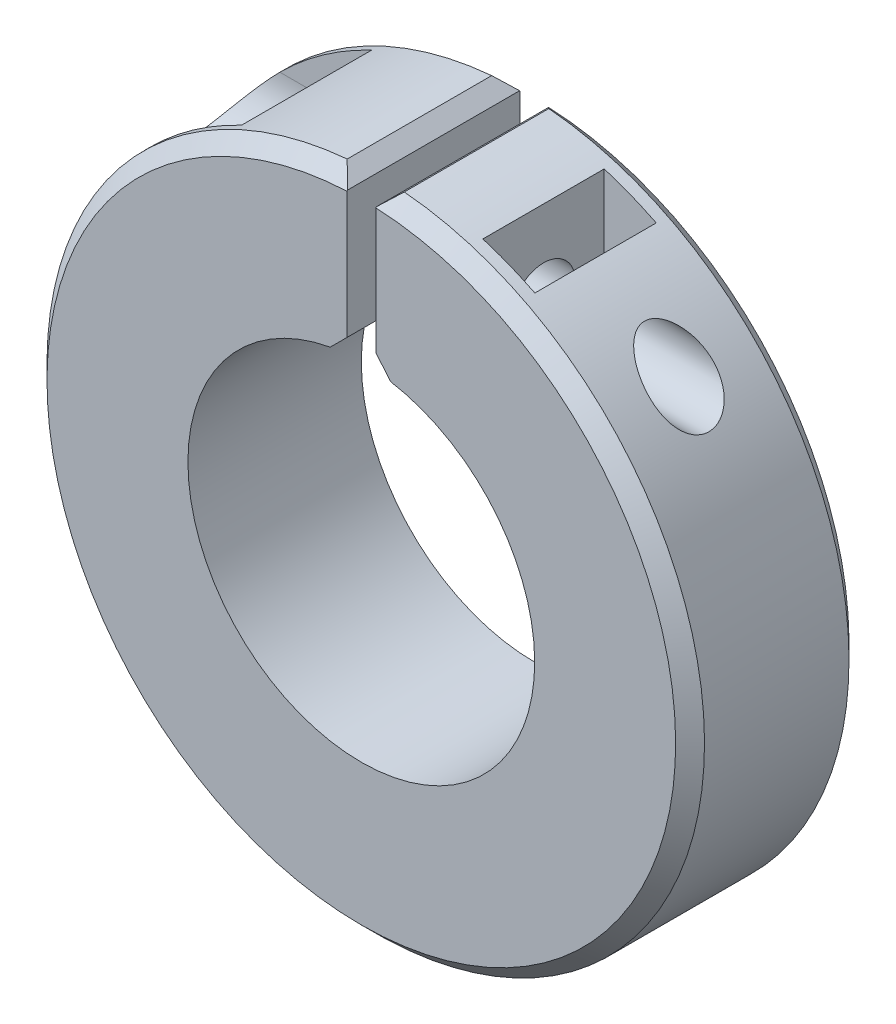
ISO-10303-21;
HEADER;
FILE_DESCRIPTION(('STEP AP214'),'2;1');
FILE_NAME('part.step','',(''),(''),'','','');
FILE_SCHEMA(('AUTOMOTIVE_DESIGN { 1 0 10303 214 1 1 1 1 }'));
ENDSEC;
DATA;
#1=APPLICATION_CONTEXT('core data for automotive mechanical design processes');
#2=APPLICATION_PROTOCOL_DEFINITION('international standard','automotive_design',2000,#1);
#3=PRODUCT_CONTEXT('',#1,'mechanical');
#4=PRODUCT('Part','Part','',(#3));
#5=PRODUCT_RELATED_PRODUCT_CATEGORY('part','',(#4));
#6=PRODUCT_DEFINITION_FORMATION('','',#4);
#7=PRODUCT_DEFINITION_CONTEXT('part definition',#1,'design');
#8=PRODUCT_DEFINITION('design','',#6,#7);
#9=PRODUCT_DEFINITION_SHAPE('','',#8);
#10=(LENGTH_UNIT() NAMED_UNIT(*) SI_UNIT(.MILLI.,.METRE.));
#11=(NAMED_UNIT(*) PLANE_ANGLE_UNIT() SI_UNIT($,.RADIAN.));
#12=(NAMED_UNIT(*) SI_UNIT($,.STERADIAN.) SOLID_ANGLE_UNIT());
#13=UNCERTAINTY_MEASURE_WITH_UNIT(LENGTH_MEASURE(1.E-05),#10,'distance_accuracy_value','');
#14=(GEOMETRIC_REPRESENTATION_CONTEXT(3) GLOBAL_UNCERTAINTY_ASSIGNED_CONTEXT((#13)) GLOBAL_UNIT_ASSIGNED_CONTEXT((#10,
#11,#12)) REPRESENTATION_CONTEXT('',''));
#15=CARTESIAN_POINT('',(0.,0.,0.));
#16=DIRECTION('',(0.,0.,1.));
#17=DIRECTION('',(1.,0.,0.));
#18=AXIS2_PLACEMENT_3D('',#15,#16,#17);
#19=CARTESIAN_POINT('',(11.3772735428193,8.02108519131541,322.453390593277));
#20=DIRECTION('',(-1.,0.,0.));
#21=DIRECTION('',(0.,0.,1.));
#22=AXIS2_PLACEMENT_3D('',#19,#20,#21);
#23=CYLINDRICAL_SURFACE('',#22,1.09999999999999);
#24=CARTESIAN_POINT('',(-0.5,8.02108519131541,322.453390593277));
#25=DIRECTION('',(-1.,0.,0.));
#26=DIRECTION('',(0.,-1.,0.));
#27=AXIS2_PLACEMENT_3D('',#24,#25,#26);
#28=CIRCLE('',#27,1.09999999999999);
#29=CARTESIAN_POINT('',(-0.5,6.92108519131542,322.453390593277));
#30=VERTEX_POINT('',#29);
#31=EDGE_CURVE('E359',#30,#30,#28,.F.);
#32=ORIENTED_EDGE('',*,*,#31,.T.);
#33=EDGE_LOOP('',(#32));
#34=FACE_BOUND('',#33,.T.);
#35=CARTESIAN_POINT('',(-4.89358378503082,8.02108519131541,322.453390593277));
#36=DIRECTION('',(-1.,0.,0.));
#37=DIRECTION('',(0.,0.,1.));
#38=AXIS2_PLACEMENT_3D('',#35,#36,#37);
#39=CIRCLE('',#38,1.09999999999999);
#40=CARTESIAN_POINT('',(-4.89358378503082,8.02108519131541,323.553390593277));
#41=VERTEX_POINT('',#40);
#42=EDGE_CURVE('E215',#41,#41,#39,.T.);
#43=ORIENTED_EDGE('',*,*,#42,.T.);
#44=EDGE_LOOP('',(#43));
#45=FACE_BOUND('',#44,.T.);
#46=ADVANCED_FACE('F39',(#34,#45),#23,.F.);
#47=CARTESIAN_POINT('',(0.,0.,319.453390593277));
#48=DIRECTION('',(0.,0.,1.));
#49=DIRECTION('',(1.,0.,0.));
#50=AXIS2_PLACEMENT_3D('',#47,#48,#49);
#51=CYLINDRICAL_SURFACE('',#50,11.3772735428193);
#52=CARTESIAN_POINT('',(0.,0.,324.953390593277));
#53=DIRECTION('',(0.,0.,1.));
#54=DIRECTION('',(1.,0.,0.));
#55=AXIS2_PLACEMENT_3D('',#52,#53,#54);
#56=CIRCLE('',#55,11.3772735428193);
#57=CARTESIAN_POINT('',(0.988530535673437,11.3342472466493,324.953390593277));
#58=VERTEX_POINT('',#57);
#59=CARTESIAN_POINT('',(-0.98853053567343,11.3342472466493,324.953390593277));
#60=VERTEX_POINT('',#59);
#61=EDGE_CURVE('E470',#58,#60,#56,.F.);
#62=ORIENTED_EDGE('',*,*,#61,.T.);
#63=DIRECTION('',(0.,0.,1.));
#64=VECTOR('',#63,1.);
#65=CARTESIAN_POINT('',(-0.98853053567343,11.3342472466493,319.453390593277));
#66=LINE('',#65,#64);
#67=CARTESIAN_POINT('',(-0.98853053567343,11.3342472466493,319.953390593278));
#68=VERTEX_POINT('',#67);
#69=EDGE_CURVE('E468',#60,#68,#66,.F.);
#70=ORIENTED_EDGE('',*,*,#69,.T.);
#71=CARTESIAN_POINT('',(0.,0.,319.953390593278));
#72=DIRECTION('',(0.,0.,1.));
#73=DIRECTION('',(1.,0.,0.));
#74=AXIS2_PLACEMENT_3D('',#71,#72,#73);
#75=CIRCLE('',#74,11.3772735428193);
#76=CARTESIAN_POINT('',(0.988530535673437,11.3342472466493,319.953390593278));
#77=VERTEX_POINT('',#76);
#78=EDGE_CURVE('E473',#68,#77,#75,.T.);
#79=ORIENTED_EDGE('',*,*,#78,.T.);
#80=DIRECTION('',(0.,0.,1.));
#81=VECTOR('',#80,1.);
#82=CARTESIAN_POINT('',(0.988530535673438,11.3342472466493,319.453390593277));
#83=LINE('',#82,#81);
#84=EDGE_CURVE('E475',#77,#58,#83,.T.);
#85=ORIENTED_EDGE('',*,*,#84,.T.);
#86=EDGE_LOOP('',(#62,#70,#79,#85));
#87=FACE_BOUND('',#86,.T.);
#88=DIRECTION('',(0.,0.,1.));
#89=VECTOR('',#88,1.);
#90=CARTESIAN_POINT('',(5.10641621496918,10.1669497248504,319.453390593277));
#91=LINE('',#90,#89);
#92=CARTESIAN_POINT('',(5.10641621496918,10.1669497248504,324.553390593277));
#93=VERTEX_POINT('',#92);
#94=CARTESIAN_POINT('',(5.10641621496918,10.1669497248504,320.353390593277));
#95=VERTEX_POINT('',#94);
#96=EDGE_CURVE('E213',#93,#95,#91,.F.);
#97=ORIENTED_EDGE('',*,*,#96,.F.);
#98=CARTESIAN_POINT('',(0.,0.,324.553390593277));
#99=DIRECTION('',(0.,0.,-1.));
#100=DIRECTION('',(-1.,0.,0.));
#101=AXIS2_PLACEMENT_3D('',#98,#99,#100);
#102=CIRCLE('',#101,11.3772735428193);
#103=CARTESIAN_POINT('',(3.30641621496918,10.8862282302699,324.553390593277));
#104=VERTEX_POINT('',#103);
#105=EDGE_CURVE('E271',#93,#104,#102,.F.);
#106=ORIENTED_EDGE('',*,*,#105,.T.);
#107=DIRECTION('',(0.,0.,1.));
#108=VECTOR('',#107,1.);
#109=CARTESIAN_POINT('',(3.30641621496918,10.8862282302699,319.453390593277));
#110=LINE('',#109,#108);
#111=CARTESIAN_POINT('',(3.30641621496918,10.8862282302699,320.353390593277));
#112=VERTEX_POINT('',#111);
#113=EDGE_CURVE('E205',#104,#112,#110,.F.);
#114=ORIENTED_EDGE('',*,*,#113,.T.);
#115=CARTESIAN_POINT('',(0.,0.,320.353390593277));
#116=DIRECTION('',(0.,0.,1.));
#117=DIRECTION('',(1.,0.,0.));
#118=AXIS2_PLACEMENT_3D('',#115,#116,#117);
#119=CIRCLE('',#118,11.3772735428193);
#120=EDGE_CURVE('E277',#112,#95,#119,.F.);
#121=ORIENTED_EDGE('',*,*,#120,.T.);
#122=EDGE_LOOP('',(#97,#106,#114,#121));
#123=FACE_BOUND('',#122,.T.);
#124=CARTESIAN_POINT('',(8.06873878755513,8.02108519131541,323.553390593277));
#125=CARTESIAN_POINT('',(8.13419799544364,7.95523722157848,323.553390436037));
#126=CARTESIAN_POINT('',(8.19885524797418,7.88857512960789,323.547494872667));
#127=CARTESIAN_POINT('',(8.32540879857754,7.75489350094532,323.522856722746));
#128=CARTESIAN_POINT('',(8.38730526720678,7.68787398662146,323.504114930987));
#129=CARTESIAN_POINT('',(8.49913749995524,7.56393218795188,323.455812053112));
#130=CARTESIAN_POINT('',(8.54958820369349,7.50681898200338,323.427950560727));
#131=CARTESIAN_POINT('',(8.64593750834966,7.39564083546103,323.36060102943));
#132=CARTESIAN_POINT('',(8.69184130948544,7.34157244384051,323.321126482287));
#133=CARTESIAN_POINT('',(8.76866289253158,7.24953389676741,323.239320235526));
#134=CARTESIAN_POINT('',(8.8007247152446,7.21053422049426,323.199228120861));
#135=CARTESIAN_POINT('',(8.85987360393305,7.13772978933381,323.111362604787));
#136=CARTESIAN_POINT('',(8.8869662127495,7.10391925325103,323.063597874673));
#137=CARTESIAN_POINT('',(8.93125153908117,7.04813229419682,322.969032953939));
#138=CARTESIAN_POINT('',(8.9493303339184,7.02513166178924,322.923254680345));
#139=CARTESIAN_POINT('',(8.98042351370397,6.98534085118089,322.827448167334));
#140=CARTESIAN_POINT('',(8.99343988050689,6.9685482427718,322.777421600415));
#141=CARTESIAN_POINT('',(9.01384461456682,6.94213535796251,322.674120220993));
#142=CARTESIAN_POINT('',(9.02120571319764,6.93254983744178,322.620830991499));
#143=CARTESIAN_POINT('',(9.02979307851886,6.92136137073332,322.512934308412));
#144=CARTESIAN_POINT('',(9.03102137136142,6.91975578813999,322.458327296178));
#145=CARTESIAN_POINT('',(9.02744279501485,6.92442298337805,322.354359463626));
#146=CARTESIAN_POINT('',(9.02314276845133,6.93003413957071,322.3049491552));
#147=CARTESIAN_POINT('',(9.00956816061822,6.94767279024034,322.20800724614));
#148=CARTESIAN_POINT('',(9.00029377106121,6.95970003744026,322.160475573179));
#149=CARTESIAN_POINT('',(8.97704062711779,6.98966772506335,322.067941763071));
#150=CARTESIAN_POINT('',(8.96301112630929,7.00767190669873,322.022973298008));
#151=CARTESIAN_POINT('',(8.93080835966013,7.04866606868939,321.936987075499));
#152=CARTESIAN_POINT('',(8.91263391093269,7.07165747220816,321.895970450594));
#153=CARTESIAN_POINT('',(8.87042813157629,7.12454376813006,321.813970870519));
#154=CARTESIAN_POINT('',(8.84596483630395,7.15492732248187,321.773527420311));
#155=CARTESIAN_POINT('',(8.79336664904601,7.21947345919028,321.698490871236));
#156=CARTESIAN_POINT('',(8.76522926623596,7.25363860283593,321.663901778156));
#157=CARTESIAN_POINT('',(8.69147567650685,7.34202352381444,321.585124639525));
#158=CARTESIAN_POINT('',(8.64402935629384,7.3978953307076,321.544486595238));
#159=CARTESIAN_POINT('',(8.54430655227201,7.5128565595056,321.475526914745));
#160=CARTESIAN_POINT('',(8.4920199535704,7.57195260842165,321.447231809957));
#161=CARTESIAN_POINT('',(8.36743908039974,7.70969139261483,321.395092148205));
#162=CARTESIAN_POINT('',(8.29393241530082,7.78876244138324,321.375284312445));
#163=CARTESIAN_POINT('',(8.14346413603564,7.94595737726953,321.353085945875));
#164=CARTESIAN_POINT('',(8.06649970870372,8.02408042500169,321.350709865162));
#165=CARTESIAN_POINT('',(7.90955435100821,8.17885491468219,321.361952697905));
#166=CARTESIAN_POINT('',(7.82954406390905,8.25545462252588,321.375860040794));
#167=CARTESIAN_POINT('',(7.66962521747124,8.40423218904353,321.419364027422));
#168=CARTESIAN_POINT('',(7.58971667245338,8.47640948087444,321.44896267772));
#169=CARTESIAN_POINT('',(7.44303991073207,8.6053305441214,321.518898537358));
#170=CARTESIAN_POINT('',(7.37597138563548,8.6628339561287,321.557208783552));
#171=CARTESIAN_POINT('',(7.24569459841096,8.7720820790236,321.646557563664));
#172=CARTESIAN_POINT('',(7.18247908030914,8.82383777533058,321.697571190822));
#173=CARTESIAN_POINT('',(7.08630068998664,8.90106419514713,321.791730326199));
#174=CARTESIAN_POINT('',(7.0510020206024,8.92902628003682,321.830444151592));
#175=CARTESIAN_POINT('',(6.98475249911632,8.98094323932491,321.913871380071));
#176=CARTESIAN_POINT('',(6.9537956973386,9.00490360605909,321.958576405717));
#177=CARTESIAN_POINT('',(6.90493438319942,9.04239750483778,322.042884441363));
#178=CARTESIAN_POINT('',(6.88567475085066,9.05705667605565,322.081190980568));
#179=CARTESIAN_POINT('',(6.85222005516111,9.08239368409729,322.16119821454));
#180=CARTESIAN_POINT('',(6.83801736286917,9.09307751925946,322.202893679004));
#181=CARTESIAN_POINT('',(6.8177370755399,9.10829022440171,322.282088421086));
#182=CARTESIAN_POINT('',(6.81073078764729,9.11352447299242,322.319211084303));
#183=CARTESIAN_POINT('',(6.80185762862985,9.12014903843459,322.394401676771));
#184=CARTESIAN_POINT('',(6.79998744678623,9.12154183147945,322.43246898113));
#185=CARTESIAN_POINT('',(6.80156739467081,9.120363742418,322.508445603341));
#186=CARTESIAN_POINT('',(6.80501999025771,9.11779102322713,322.546354839806));
#187=CARTESIAN_POINT('',(6.81691382061168,9.10890182953345,322.620928905873));
#188=CARTESIAN_POINT('',(6.82535885480551,9.10258250371657,322.657592765202));
#189=CARTESIAN_POINT('',(6.84938530686184,9.0845227163534,322.738422073182));
#190=CARTESIAN_POINT('',(6.86627086240936,9.07178471680746,322.781973209796));
#191=CARTESIAN_POINT('',(6.90531626541429,9.04209949001199,322.865079457754));
#192=CARTESIAN_POINT('',(6.92748611424316,9.02514427833252,322.904626786541));
#193=CARTESIAN_POINT('',(6.98713666887674,8.97910196311206,322.997472578914));
#194=CARTESIAN_POINT('',(7.02687956953758,8.9480835344006,323.048345323501));
#195=CARTESIAN_POINT('',(7.11149035699483,8.88099128833574,323.141780148419));
#196=CARTESIAN_POINT('',(7.15637034841035,8.84490548333245,323.184321931917));
#197=CARTESIAN_POINT('',(7.27370811319863,8.74893458046126,323.282313499344));
#198=CARTESIAN_POINT('',(7.3482522131905,8.68651684034621,323.332778757443));
#199=CARTESIAN_POINT('',(7.50051732760421,8.5553930390172,323.418080824386));
#200=CARTESIAN_POINT('',(7.57824077429957,8.48668211163029,323.452905414222));
#201=CARTESIAN_POINT('',(7.72528241142001,8.35290653053916,323.504292254857));
#202=CARTESIAN_POINT('',(7.79450592522495,8.28837375006615,323.522528864531));
#203=CARTESIAN_POINT('',(7.93235205627186,8.15654495204298,323.54707311801));
#204=CARTESIAN_POINT('',(8.00097512888409,8.08925129795444,323.553390756053));
#205=CARTESIAN_POINT('',(8.06873878755513,8.02108519131541,323.553390593277));
#206=B_SPLINE_CURVE_WITH_KNOTS('',3,(#124,#125,#126,#127,#128,#129,#130,#131,#132,#133,#134,
#135,#136,#137,#138,#139,#140,#141,#142,#143,#144,#145,#146,#147,#148,#149,#150,#151,#152,#153,
#154,#155,#156,#157,#158,#159,#160,#161,#162,#163,#164,#165,#166,#167,#168,#169,#170,#171,#172,
#173,#174,#175,#176,#177,#178,#179,#180,#181,#182,#183,#184,#185,#186,#187,#188,#189,#190,#191,
#192,#193,#194,#195,#196,#197,#198,#199,#200,#201,#202,#203,#204,#205),.UNSPECIFIED.,.T.,.F.,(4,
2,2,2,2,2,2,2,2,2,2,2,2,2,2,2,2,2,2,2,2,2,2,2,2,2,2,2,2,2,2,2,2,2,2,2,2,2,2,2,4),(0.,
0.278343473950357,0.556669728442386,0.79923381377863,1.04151719938212,1.2341967707426,
1.42666009564916,1.58896163248053,1.75119956690725,1.91421495550189,2.07717648361915,
2.22620996535901,2.37523770374218,2.52590874145476,2.67662283164831,2.84456026230144,
3.01261214199396,3.26265319912206,3.51322910785106,3.84077334921865,4.16858907854234,
4.50230038817185,4.83605438214404,5.12407976754291,5.41154482478995,5.58926117056258,
5.76673156068403,5.90220096031759,6.03746511476441,6.15137673116412,6.26521490321854,
6.37910582841046,6.49308354050865,6.63752636592858,6.78224477422384,6.99591439829325,
7.21009828330773,7.53696873805933,7.86409411255998,8.15247841800768,8.44062080118788),.UNSPECIFIED.);
#207=CARTESIAN_POINT('',(8.06873878755513,8.02108519131541,323.553390593277));
#208=VERTEX_POINT('',#207);
#209=EDGE_CURVE('E218',#208,#208,#206,.T.);
#210=ORIENTED_EDGE('',*,*,#209,.F.);
#211=EDGE_LOOP('',(#210));
#212=FACE_BOUND('',#211,.T.);
#213=CARTESIAN_POINT('',(0.,0.,324.703390593277));
#214=DIRECTION('',(0.,0.,1.));
#215=DIRECTION('',(1.,0.,0.));
#216=AXIS2_PLACEMENT_3D('',#213,#214,#215);
#217=CIRCLE('',#216,11.3772735428193);
#218=CARTESIAN_POINT('',(-8.06873878755513,8.02108519131541,324.703390593277));
#219=VERTEX_POINT('',#218);
#220=CARTESIAN_POINT('',(-4.89358378503082,10.2710851913038,324.703390593277));
#221=VERTEX_POINT('',#220);
#222=EDGE_CURVE('E267',#219,#221,#217,.F.);
#223=ORIENTED_EDGE('',*,*,#222,.F.);
#224=CARTESIAN_POINT('',(-8.06873878755513,8.02108519131541,320.203390593277));
#225=CARTESIAN_POINT('',(-8.13551263076985,7.95392722340364,320.203396809345));
#226=CARTESIAN_POINT('',(-8.20145995912195,7.88589843451153,320.206399117038));
#227=CARTESIAN_POINT('',(-8.33144806549425,7.74843446404324,320.218901438893));
#228=CARTESIAN_POINT('',(-8.39548572965339,7.6789972658449,320.228411518115));
#229=CARTESIAN_POINT('',(-8.52172088232586,7.53867450876376,320.254547529734));
#230=CARTESIAN_POINT('',(-8.58389834151709,7.46778167800933,320.271232691476));
#231=CARTESIAN_POINT('',(-8.70536842347618,7.32582058072846,320.312230598037));
#232=CARTESIAN_POINT('',(-8.76466287293524,7.25475245607534,320.336538438379));
#233=CARTESIAN_POINT('',(-8.91256628316013,7.07310789684687,320.409354593062));
#234=CARTESIAN_POINT('',(-8.99882033517275,6.96288444679273,320.463777427772));
#235=CARTESIAN_POINT('',(-9.16099393124427,6.74808047568554,320.593915363407));
#236=CARTESIAN_POINT('',(-9.23694958527804,6.64348105680305,320.669553054172));
#237=CARTESIAN_POINT('',(-9.3664529557537,6.45931004892415,320.82982037415));
#238=CARTESIAN_POINT('',(-9.42165333219912,6.37832310280961,320.911475114645));
#239=CARTESIAN_POINT('',(-9.52207096913754,6.2274185532392,321.089973458057));
#240=CARTESIAN_POINT('',(-9.56728456364406,6.15750501730914,321.186822616362));
#241=CARTESIAN_POINT('',(-9.64679721207819,6.03218222419049,321.394367467776));
#242=CARTESIAN_POINT('',(-9.68103845405879,5.97685005730771,321.505132356555));
#243=CARTESIAN_POINT('',(-9.73741419095665,5.8845625864918,321.736937216623));
#244=CARTESIAN_POINT('',(-9.75955534458225,5.84759717630665,321.85797149419));
#245=CARTESIAN_POINT('',(-9.78960582710361,5.79713214641975,322.093469986537));
#246=CARTESIAN_POINT('',(-9.79873171803235,5.78163135372316,322.20735388675));
#247=CARTESIAN_POINT('',(-9.80662932733087,5.76822714744707,322.436493906071));
#248=CARTESIAN_POINT('',(-9.80540467913991,5.77031755867402,322.551749529465));
#249=CARTESIAN_POINT('',(-9.79293435194685,5.7914522891011,322.774602016518));
#250=CARTESIAN_POINT('',(-9.78216441809358,5.80969168584008,322.882303594864));
#251=CARTESIAN_POINT('',(-9.75144629070035,5.86110373660042,323.092691501714));
#252=CARTESIAN_POINT('',(-9.73149866825107,5.89427546144023,323.195378141836));
#253=CARTESIAN_POINT('',(-9.68241155116305,5.97457044305528,323.394663417804));
#254=CARTESIAN_POINT('',(-9.65313757580243,6.02189715380799,323.491146463228));
#255=CARTESIAN_POINT('',(-9.58604399588447,6.12813599572184,323.674233351987));
#256=CARTESIAN_POINT('',(-9.54822183878201,6.1870515867185,323.760834232795));
#257=CARTESIAN_POINT('',(-9.46167602028526,6.31867607469962,323.928684676983));
#258=CARTESIAN_POINT('',(-9.4123578405323,6.39207817542667,324.009081218419));
#259=CARTESIAN_POINT('',(-9.30570702296889,6.54637075996319,324.156060473094));
#260=CARTESIAN_POINT('',(-9.24837412833246,6.62726148371236,324.222642743494));
#261=CARTESIAN_POINT('',(-9.11848949663876,6.80508455559322,324.350063785323));
#262=CARTESIAN_POINT('',(-9.0449282190006,6.90270600391572,324.408904413466));
#263=CARTESIAN_POINT('',(-8.89021653483896,7.10086482614958,324.509623525833));
#264=CARTESIAN_POINT('',(-8.80904998080316,7.20140807666923,324.551464864746));
#265=CARTESIAN_POINT('',(-8.6226765296507,7.42408595667094,324.626561522966));
#266=CARTESIAN_POINT('',(-8.5160261976056,7.54626867734381,324.656103014086));
#267=CARTESIAN_POINT('',(-8.35133634372771,7.72684832445702,324.684897790134));
#268=CARTESIAN_POINT('',(-8.29578856851162,7.78645699117235,324.691911371906));
#269=CARTESIAN_POINT('',(-8.18328526813401,7.90460857421248,324.701151731181));
#270=CARTESIAN_POINT('',(-8.12633108776726,7.96315242225198,324.703382914982));
#271=CARTESIAN_POINT('',(-8.06873878755513,8.02108519131541,324.703390593277));
#272=B_SPLINE_CURVE_WITH_KNOTS('',3,(#224,#225,#226,#227,#228,#229,#230,#231,#232,#233,#234,
#235,#236,#237,#238,#239,#240,#241,#242,#243,#244,#245,#246,#247,#248,#249,#250,#251,#252,#253,
#254,#255,#256,#257,#258,#259,#260,#261,#262,#263,#264,#265,#266,#267,#268,#269,#270,#271),
.UNSPECIFIED.,.F.,.F.,(4,2,2,2,2,2,2,2,2,2,2,2,2,2,2,2,2,2,2,2,2,2,2,4),(0.,0.28410949893573,
0.56865940387877,0.8556047318457,1.14236581497815,1.59106574168695,2.03814925852667,
2.41924533203505,2.80048106812369,3.18369366293628,3.56669516201925,3.91081667812633,
4.25481739930072,4.58258046604722,4.91032314017282,5.24302357042188,5.57582347884491,
5.93293404551933,6.29005605817934,6.69552953882858,7.10188431897127,7.59458796518256,
7.83980224624937,8.08479049998168),.UNSPECIFIED.);
#273=CARTESIAN_POINT('',(-8.06873878755513,8.02108519131541,320.203390593277));
#274=VERTEX_POINT('',#273);
#275=EDGE_CURVE('E260',#274,#219,#272,.T.);
#276=ORIENTED_EDGE('',*,*,#275,.F.);
#277=CARTESIAN_POINT('',(0.,0.,320.203390593277));
#278=DIRECTION('',(0.,0.,-1.));
#279=DIRECTION('',(-1.,0.,0.));
#280=AXIS2_PLACEMENT_3D('',#277,#278,#279);
#281=CIRCLE('',#280,11.3772735428193);
#282=CARTESIAN_POINT('',(-4.89358378503082,10.2710851913154,320.203390593277));
#283=VERTEX_POINT('',#282);
#284=EDGE_CURVE('E268',#283,#274,#281,.F.);
#285=ORIENTED_EDGE('',*,*,#284,.F.);
#286=DIRECTION('',(0.,0.,1.));
#287=VECTOR('',#286,1.);
#288=CARTESIAN_POINT('',(-4.89358378503082,10.2710851913154,324.703390593277));
#289=LINE('',#288,#287);
#290=EDGE_CURVE('E386',#283,#221,#289,.T.);
#291=ORIENTED_EDGE('',*,*,#290,.T.);
#292=EDGE_LOOP('',(#223,#276,#285,#291));
#293=FACE_BOUND('',#292,.T.);
#294=ADVANCED_FACE('F228',(#87,#123,#212,#293),#51,.T.);
#295=CARTESIAN_POINT('',(0.500000000000002,8.02108519131541,322.453390593277));
#296=DIRECTION('',(1.,0.,0.));
#297=DIRECTION('',(0.,1.,0.));
#298=AXIS2_PLACEMENT_3D('',#295,#296,#297);
#299=CIRCLE('',#298,1.09999999999999);
#300=CARTESIAN_POINT('',(0.500000000000002,9.12108519131541,322.453390593277));
#301=VERTEX_POINT('',#300);
#302=EDGE_CURVE('E355',#301,#301,#299,.F.);
#303=ORIENTED_EDGE('',*,*,#302,.T.);
#304=EDGE_LOOP('',(#303));
#305=FACE_BOUND('',#304,.T.);
#306=CARTESIAN_POINT('',(3.30641621496918,8.02108519131541,322.453390593277));
#307=DIRECTION('',(1.,0.,0.));
#308=DIRECTION('',(0.,0.,-1.));
#309=AXIS2_PLACEMENT_3D('',#306,#307,#308);
#310=CIRCLE('',#309,1.09999999999999);
#311=CARTESIAN_POINT('',(3.30641621496918,8.02108519131541,321.353390593277));
#312=VERTEX_POINT('',#311);
#313=EDGE_CURVE('E201',#312,#312,#310,.F.);
#314=ORIENTED_EDGE('',*,*,#313,.F.);
#315=EDGE_LOOP('',(#314));
#316=FACE_BOUND('',#315,.T.);
#317=ADVANCED_FACE('F239',(#305,#316),#23,.F.);
#318=CARTESIAN_POINT('',(0.,0.,319.453390593277));
#319=DIRECTION('',(0.,0.,1.));
#320=DIRECTION('',(1.,0.,0.));
#321=AXIS2_PLACEMENT_3D('',#318,#319,#320);
#322=CYLINDRICAL_SURFACE('',#321,5.99999999998992);
#323=CARTESIAN_POINT('',(0.,0.,319.453390593277));
#324=DIRECTION('',(0.,0.,1.));
#325=DIRECTION('',(1.,0.,0.));
#326=AXIS2_PLACEMENT_3D('',#323,#324,#325);
#327=CIRCLE('',#326,5.99999999998992);
#328=CARTESIAN_POINT('',(-1.07648938625642,5.90264098528416,319.453390593277));
#329=VERTEX_POINT('',#328);
#330=CARTESIAN_POINT('',(1.01910162368152,5.91281928359803,319.453390593277));
#331=VERTEX_POINT('',#330);
#332=EDGE_CURVE('E396',#329,#331,#327,.T.);
#333=ORIENTED_EDGE('',*,*,#332,.F.);
#334=DIRECTION('',(0.,0.,1.));
#335=VECTOR('',#334,1.);
#336=CARTESIAN_POINT('',(-1.07648938625642,5.90264098528416,319.453390593277));
#337=LINE('',#336,#335);
#338=CARTESIAN_POINT('',(-1.07648938625642,5.90264098528416,325.453390593277));
#339=VERTEX_POINT('',#338);
#340=EDGE_CURVE('E11',#329,#339,#337,.T.);
#341=ORIENTED_EDGE('',*,*,#340,.T.);
#342=CARTESIAN_POINT('',(0.,0.,325.453390593277));
#343=DIRECTION('',(0.,0.,1.));
#344=DIRECTION('',(1.,0.,0.));
#345=AXIS2_PLACEMENT_3D('',#342,#343,#344);
#346=CIRCLE('',#345,5.99999999998992);
#347=CARTESIAN_POINT('',(1.01910162368152,5.91281928359803,325.453390593277));
#348=VERTEX_POINT('',#347);
#349=EDGE_CURVE('E393',#339,#348,#346,.T.);
#350=ORIENTED_EDGE('',*,*,#349,.T.);
#351=DIRECTION('',(0.,0.,1.));
#352=VECTOR('',#351,1.);
#353=CARTESIAN_POINT('',(1.01910162368152,5.91281928359804,319.453390593277));
#354=LINE('',#353,#352);
#355=EDGE_CURVE('E55',#348,#331,#354,.F.);
#356=ORIENTED_EDGE('',*,*,#355,.T.);
#357=EDGE_LOOP('',(#333,#341,#350,#356));
#358=FACE_BOUND('',#357,.T.);
#359=ADVANCED_FACE('F347',(#358),#322,.F.);
#360=CARTESIAN_POINT('',(0.,0.,319.453390593277));
#361=DIRECTION('',(0.,0.,1.));
#362=DIRECTION('',(1.,0.,0.));
#363=AXIS2_PLACEMENT_3D('',#360,#361,#362);
#364=PLANE('',#363);
#365=DIRECTION('',(0.,1.,0.));
#366=VECTOR('',#365,1.);
#367=CARTESIAN_POINT('',(0.500000000000002,5.97913037154059,319.453390593277));
#368=LINE('',#367,#366);
#369=CARTESIAN_POINT('',(0.500000000000002,6.52666251561539,319.453390593277));
#370=VERTEX_POINT('',#369);
#371=CARTESIAN_POINT('',(0.5,10.8657756154504,319.453390593277));
#372=VERTEX_POINT('',#371);
#373=EDGE_CURVE('E364',#370,#372,#368,.T.);
#374=ORIENTED_EDGE('',*,*,#373,.T.);
#375=CARTESIAN_POINT('',(0.,0.,319.453390593277));
#376=DIRECTION('',(0.,0.,1.));
#377=DIRECTION('',(1.,0.,0.));
#378=AXIS2_PLACEMENT_3D('',#375,#376,#377);
#379=CIRCLE('',#378,10.8772735428193);
#380=CARTESIAN_POINT('',(-0.5,10.8657756154504,319.453390593277));
#381=VERTEX_POINT('',#380);
#382=EDGE_CURVE('E417',#372,#381,#379,.F.);
#383=ORIENTED_EDGE('',*,*,#382,.T.);
#384=DIRECTION('',(0.,-1.,0.));
#385=VECTOR('',#384,1.);
#386=CARTESIAN_POINT('',(-0.5,5.97913037154059,319.453390593277));
#387=LINE('',#386,#385);
#388=CARTESIAN_POINT('',(-0.5,6.47913037154059,319.453390593277));
#389=VERTEX_POINT('',#388);
#390=EDGE_CURVE('E360',#381,#389,#387,.T.);
#391=ORIENTED_EDGE('',*,*,#390,.T.);
#392=DIRECTION('',(0.707106781186546,0.707106781186549,0.));
#393=VECTOR('',#392,1.);
#394=CARTESIAN_POINT('',(-1.07648938625642,5.90264098528416,319.453390593277));
#395=LINE('',#394,#393);
#396=EDGE_CURVE('E69',#389,#329,#395,.F.);
#397=ORIENTED_EDGE('',*,*,#396,.T.);
#398=ORIENTED_EDGE('',*,*,#332,.T.);
#399=DIRECTION('',(0.645721706788006,-0.763572836985958,0.));
#400=VECTOR('',#399,1.);
#401=CARTESIAN_POINT('',(0.500000000000002,6.52666251561539,319.453390593277));
#402=LINE('',#401,#400);
#403=EDGE_CURVE('E408',#331,#370,#402,.F.);
#404=ORIENTED_EDGE('',*,*,#403,.T.);
#405=EDGE_LOOP('',(#374,#383,#391,#397,#398,#404));
#406=FACE_BOUND('',#405,.T.);
#407=ADVANCED_FACE('F258',(#406),#364,.F.);
#408=CARTESIAN_POINT('',(0.,0.,325.453390593277));
#409=DIRECTION('',(0.,0.,1.));
#410=DIRECTION('',(1.,0.,0.));
#411=AXIS2_PLACEMENT_3D('',#408,#409,#410);
#412=PLANE('',#411);
#413=DIRECTION('',(0.,-1.,0.));
#414=VECTOR('',#413,1.);
#415=CARTESIAN_POINT('',(-0.499999999999999,0.,325.453390593277));
#416=LINE('',#415,#414);
#417=CARTESIAN_POINT('',(-0.5,10.8657756154504,325.453390593277));
#418=VERTEX_POINT('',#417);
#419=CARTESIAN_POINT('',(-0.5,6.47913037154059,325.453390593277));
#420=VERTEX_POINT('',#419);
#421=EDGE_CURVE('E283',#418,#420,#416,.T.);
#422=ORIENTED_EDGE('',*,*,#421,.F.);
#423=CARTESIAN_POINT('',(0.,0.,325.453390593277));
#424=DIRECTION('',(0.,0.,1.));
#425=DIRECTION('',(1.,0.,0.));
#426=AXIS2_PLACEMENT_3D('',#423,#424,#425);
#427=CIRCLE('',#426,10.8772735428193);
#428=CARTESIAN_POINT('',(0.5,10.8657756154504,325.453390593277));
#429=VERTEX_POINT('',#428);
#430=EDGE_CURVE('E290',#418,#429,#427,.T.);
#431=ORIENTED_EDGE('',*,*,#430,.T.);
#432=DIRECTION('',(0.,1.,0.));
#433=VECTOR('',#432,1.);
#434=CARTESIAN_POINT('',(0.500000000000004,0.,325.453390593277));
#435=LINE('',#434,#433);
#436=CARTESIAN_POINT('',(0.500000000000002,6.52666251561539,325.453390593277));
#437=VERTEX_POINT('',#436);
#438=EDGE_CURVE('E280',#437,#429,#435,.T.);
#439=ORIENTED_EDGE('',*,*,#438,.F.);
#440=DIRECTION('',(-0.645721706788006,0.763572836985958,0.));
#441=VECTOR('',#440,1.);
#442=CARTESIAN_POINT('',(3.50952895125161,2.96786228458489,325.453390593277));
#443=LINE('',#442,#441);
#444=EDGE_CURVE('E286',#437,#348,#443,.F.);
#445=ORIENTED_EDGE('',*,*,#444,.T.);
#446=ORIENTED_EDGE('',*,*,#349,.F.);
#447=DIRECTION('',(-0.707106781186546,-0.707106781186549,0.));
#448=VECTOR('',#447,1.);
#449=CARTESIAN_POINT('',(-3.48956518577029,3.48956518577028,325.453390593277));
#450=LINE('',#449,#448);
#451=EDGE_CURVE('E288',#339,#420,#450,.F.);
#452=ORIENTED_EDGE('',*,*,#451,.T.);
#453=EDGE_LOOP('',(#422,#431,#439,#445,#446,#452));
#454=FACE_BOUND('',#453,.T.);
#455=ADVANCED_FACE('F256',(#454),#412,.T.);
#456=CARTESIAN_POINT('',(-11.3772735428193,8.02108519131541,322.453390593277));
#457=DIRECTION('',(1.,0.,0.));
#458=DIRECTION('',(0.,0.,-1.));
#459=AXIS2_PLACEMENT_3D('',#456,#457,#458);
#460=CYLINDRICAL_SURFACE('',#459,2.24999999999997);
#461=ORIENTED_EDGE('',*,*,#275,.T.);
#462=DIRECTION('',(1.,0.,0.));
#463=VECTOR('',#462,1.);
#464=CARTESIAN_POINT('',(-11.3772735428193,8.02108519131541,324.703390593277));
#465=LINE('',#464,#463);
#466=CARTESIAN_POINT('',(-4.89358378503082,8.02108519131541,324.703390593277));
#467=VERTEX_POINT('',#466);
#468=EDGE_CURVE('E390',#219,#467,#465,.T.);
#469=ORIENTED_EDGE('',*,*,#468,.T.);
#470=CARTESIAN_POINT('',(-4.89358378503082,8.02108519131541,322.453390593277));
#471=DIRECTION('',(1.,0.,0.));
#472=DIRECTION('',(0.,0.,1.));
#473=AXIS2_PLACEMENT_3D('',#470,#471,#472);
#474=CIRCLE('',#473,2.24999999999997);
#475=CARTESIAN_POINT('',(-4.89358378503082,8.02108519131541,320.203390593277));
#476=VERTEX_POINT('',#475);
#477=EDGE_CURVE('E226',#467,#476,#474,.T.);
#478=ORIENTED_EDGE('',*,*,#477,.T.);
#479=DIRECTION('',(1.,0.,0.));
#480=VECTOR('',#479,1.);
#481=CARTESIAN_POINT('',(-11.3772735428193,8.02108519131541,320.203390593277));
#482=LINE('',#481,#480);
#483=EDGE_CURVE('E394',#274,#476,#482,.T.);
#484=ORIENTED_EDGE('',*,*,#483,.F.);
#485=EDGE_LOOP('',(#461,#469,#478,#484));
#486=FACE_BOUND('',#485,.T.);
#487=ADVANCED_FACE('F248',(#486),#460,.F.);
#488=CARTESIAN_POINT('',(-11.3772735428193,8.02108519131541,324.703390593277));
#489=DIRECTION('',(0.,0.,1.));
#490=DIRECTION('',(1.,0.,0.));
#491=AXIS2_PLACEMENT_3D('',#488,#489,#490);
#492=PLANE('',#491);
#493=ORIENTED_EDGE('',*,*,#222,.T.);
#494=DIRECTION('',(0.,-1.,0.));
#495=VECTOR('',#494,1.);
#496=CARTESIAN_POINT('',(-4.89358378503082,8.02108519131541,324.703390593277));
#497=LINE('',#496,#495);
#498=EDGE_CURVE('E389',#221,#467,#497,.T.);
#499=ORIENTED_EDGE('',*,*,#498,.T.);
#500=ORIENTED_EDGE('',*,*,#468,.F.);
#501=EDGE_LOOP('',(#493,#499,#500));
#502=FACE_BOUND('',#501,.T.);
#503=ADVANCED_FACE('F245',(#502),#492,.F.);
#504=CARTESIAN_POINT('',(-11.3772735428193,10.2710851913154,320.203390593277));
#505=DIRECTION('',(0.,0.,-1.));
#506=DIRECTION('',(-1.,0.,0.));
#507=AXIS2_PLACEMENT_3D('',#504,#505,#506);
#508=PLANE('',#507);
#509=ORIENTED_EDGE('',*,*,#284,.T.);
#510=ORIENTED_EDGE('',*,*,#483,.T.);
#511=DIRECTION('',(0.,1.,0.));
#512=VECTOR('',#511,1.);
#513=CARTESIAN_POINT('',(-4.89358378503082,10.2710851913154,320.203390593277));
#514=LINE('',#513,#512);
#515=EDGE_CURVE('E405',#476,#283,#514,.T.);
#516=ORIENTED_EDGE('',*,*,#515,.T.);
#517=EDGE_LOOP('',(#509,#510,#516));
#518=FACE_BOUND('',#517,.T.);
#519=ADVANCED_FACE('F243',(#518),#508,.F.);
#520=CARTESIAN_POINT('',(-4.89358378503082,8.02108519131541,322.453390593277));
#521=DIRECTION('',(-1.,0.,0.));
#522=DIRECTION('',(0.,0.,1.));
#523=AXIS2_PLACEMENT_3D('',#520,#521,#522);
#524=PLANE('',#523);
#525=ORIENTED_EDGE('',*,*,#42,.F.);
#526=EDGE_LOOP('',(#525));
#527=FACE_BOUND('',#526,.T.);
#528=ORIENTED_EDGE('',*,*,#477,.F.);
#529=ORIENTED_EDGE('',*,*,#498,.F.);
#530=ORIENTED_EDGE('',*,*,#290,.F.);
#531=ORIENTED_EDGE('',*,*,#515,.F.);
#532=EDGE_LOOP('',(#528,#529,#530,#531));
#533=FACE_BOUND('',#532,.T.);
#534=ADVANCED_FACE('F237',(#527,#533),#524,.T.);
#535=CARTESIAN_POINT('',(5.10641621496918,8.02108519131541,322.453390593277));
#536=DIRECTION('',(1.,0.,0.));
#537=DIRECTION('',(0.,0.,-1.));
#538=AXIS2_PLACEMENT_3D('',#535,#536,#537);
#539=CIRCLE('',#538,1.09999999999999);
#540=CARTESIAN_POINT('',(5.10641621496918,8.02108519131541,321.353390593277));
#541=VERTEX_POINT('',#540);
#542=EDGE_CURVE('E212',#541,#541,#539,.F.);
#543=ORIENTED_EDGE('',*,*,#542,.T.);
#544=EDGE_LOOP('',(#543));
#545=FACE_BOUND('',#544,.T.);
#546=ORIENTED_EDGE('',*,*,#209,.T.);
#547=EDGE_LOOP('',(#546));
#548=FACE_BOUND('',#547,.T.);
#549=ADVANCED_FACE('F232',(#545,#548),#23,.F.);
#550=CARTESIAN_POINT('',(5.10641621496918,0.,0.));
#551=DIRECTION('',(1.,0.,0.));
#552=DIRECTION('',(0.,0.,-1.));
#553=AXIS2_PLACEMENT_3D('',#550,#551,#552);
#554=PLANE('',#553);
#555=ORIENTED_EDGE('',*,*,#96,.T.);
#556=DIRECTION('',(0.,1.,0.));
#557=VECTOR('',#556,1.);
#558=CARTESIAN_POINT('',(5.10641621496918,6.80864962601725,320.353390593277));
#559=LINE('',#558,#557);
#560=CARTESIAN_POINT('',(5.10641621496918,6.80864962601725,320.353390593277));
#561=VERTEX_POINT('',#560);
#562=EDGE_CURVE('E181',#561,#95,#559,.T.);
#563=ORIENTED_EDGE('',*,*,#562,.F.);
#564=DIRECTION('',(0.,0.500000000000004,-0.866025403784436));
#565=VECTOR('',#564,1.);
#566=CARTESIAN_POINT('',(5.10641621496918,5.59621406071905,322.453390593277));
#567=LINE('',#566,#565);
#568=CARTESIAN_POINT('',(5.10641621496918,5.59621406071905,322.453390593277));
#569=VERTEX_POINT('',#568);
#570=EDGE_CURVE('E174',#569,#561,#567,.T.);
#571=ORIENTED_EDGE('',*,*,#570,.F.);
#572=DIRECTION('',(0.,-0.499999999999996,-0.866025403784441));
#573=VECTOR('',#572,1.);
#574=CARTESIAN_POINT('',(5.10641621496918,6.80864962601722,324.553390593277));
#575=LINE('',#574,#573);
#576=CARTESIAN_POINT('',(5.10641621496918,6.80864962601722,324.553390593277));
#577=VERTEX_POINT('',#576);
#578=EDGE_CURVE('E179',#577,#569,#575,.T.);
#579=ORIENTED_EDGE('',*,*,#578,.F.);
#580=DIRECTION('',(0.,-1.,0.));
#581=VECTOR('',#580,1.);
#582=CARTESIAN_POINT('',(5.10641621496918,9.23352075661354,324.553390593277));
#583=LINE('',#582,#581);
#584=EDGE_CURVE('E369',#93,#577,#583,.T.);
#585=ORIENTED_EDGE('',*,*,#584,.F.);
#586=EDGE_LOOP('',(#555,#563,#571,#579,#585));
#587=FACE_BOUND('',#586,.T.);
#588=ORIENTED_EDGE('',*,*,#542,.F.);
#589=EDGE_LOOP('',(#588));
#590=FACE_BOUND('',#589,.T.);
#591=ADVANCED_FACE('F176',(#587,#590),#554,.F.);
#592=CARTESIAN_POINT('',(3.30641621496918,0.,0.));
#593=DIRECTION('',(1.,0.,0.));
#594=DIRECTION('',(0.,0.,-1.));
#595=AXIS2_PLACEMENT_3D('',#592,#593,#594);
#596=PLANE('',#595);
#597=DIRECTION('',(0.,-1.,0.));
#598=VECTOR('',#597,1.);
#599=CARTESIAN_POINT('',(3.30641621496918,9.23352075661354,324.553390593277));
#600=LINE('',#599,#598);
#601=CARTESIAN_POINT('',(3.30641621496918,6.80864962601722,324.553390593277));
#602=VERTEX_POINT('',#601);
#603=EDGE_CURVE('E196',#104,#602,#600,.T.);
#604=ORIENTED_EDGE('',*,*,#603,.T.);
#605=DIRECTION('',(0.,-0.499999999999996,-0.866025403784441));
#606=VECTOR('',#605,1.);
#607=CARTESIAN_POINT('',(3.30641621496918,6.80864962601722,324.553390593277));
#608=LINE('',#607,#606);
#609=CARTESIAN_POINT('',(3.30641621496918,5.59621406071905,322.453390593277));
#610=VERTEX_POINT('',#609);
#611=EDGE_CURVE('E362',#602,#610,#608,.T.);
#612=ORIENTED_EDGE('',*,*,#611,.T.);
#613=DIRECTION('',(0.,0.500000000000004,-0.866025403784436));
#614=VECTOR('',#613,1.);
#615=CARTESIAN_POINT('',(3.30641621496918,5.59621406071905,322.453390593277));
#616=LINE('',#615,#614);
#617=CARTESIAN_POINT('',(3.30641621496918,6.80864962601725,320.353390593277));
#618=VERTEX_POINT('',#617);
#619=EDGE_CURVE('E200',#610,#618,#616,.T.);
#620=ORIENTED_EDGE('',*,*,#619,.T.);
#621=DIRECTION('',(0.,1.,0.));
#622=VECTOR('',#621,1.);
#623=CARTESIAN_POINT('',(3.30641621496918,12.2335207566136,320.353390593277));
#624=LINE('',#623,#622);
#625=EDGE_CURVE('E373',#618,#112,#624,.T.);
#626=ORIENTED_EDGE('',*,*,#625,.T.);
#627=ORIENTED_EDGE('',*,*,#113,.F.);
#628=EDGE_LOOP('',(#604,#612,#620,#626,#627));
#629=FACE_BOUND('',#628,.T.);
#630=ORIENTED_EDGE('',*,*,#313,.T.);
#631=EDGE_LOOP('',(#630));
#632=FACE_BOUND('',#631,.T.);
#633=ADVANCED_FACE('F324',(#629,#632),#596,.T.);
#634=CARTESIAN_POINT('',(5.10641621496918,6.80864962601722,324.553390593277));
#635=DIRECTION('',(0.,0.866025403784441,-0.499999999999996));
#636=DIRECTION('',(0.,0.499999999999996,0.866025403784441));
#637=AXIS2_PLACEMENT_3D('',#634,#635,#636);
#638=PLANE('',#637);
#639=ORIENTED_EDGE('',*,*,#611,.F.);
#640=DIRECTION('',(-1.,0.,0.));
#641=VECTOR('',#640,1.);
#642=CARTESIAN_POINT('',(5.10641621496918,6.80864962601722,324.553390593277));
#643=LINE('',#642,#641);
#644=EDGE_CURVE('E195',#577,#602,#643,.T.);
#645=ORIENTED_EDGE('',*,*,#644,.F.);
#646=ORIENTED_EDGE('',*,*,#578,.T.);
#647=DIRECTION('',(-1.,0.,0.));
#648=VECTOR('',#647,1.);
#649=CARTESIAN_POINT('',(5.10641621496918,5.59621406071905,322.453390593277));
#650=LINE('',#649,#648);
#651=EDGE_CURVE('E192',#569,#610,#650,.T.);
#652=ORIENTED_EDGE('',*,*,#651,.T.);
#653=EDGE_LOOP('',(#639,#645,#646,#652));
#654=FACE_BOUND('',#653,.T.);
#655=ADVANCED_FACE('F191',(#654),#638,.T.);
#656=CARTESIAN_POINT('',(5.10641621496918,5.59621406071905,322.453390593277));
#657=DIRECTION('',(0.,0.866025403784436,0.500000000000004));
#658=DIRECTION('',(0.,-0.500000000000004,0.866025403784436));
#659=AXIS2_PLACEMENT_3D('',#656,#657,#658);
#660=PLANE('',#659);
#661=ORIENTED_EDGE('',*,*,#619,.F.);
#662=ORIENTED_EDGE('',*,*,#651,.F.);
#663=ORIENTED_EDGE('',*,*,#570,.T.);
#664=DIRECTION('',(-1.,0.,0.));
#665=VECTOR('',#664,1.);
#666=CARTESIAN_POINT('',(5.10641621496918,6.80864962601725,320.353390593277));
#667=LINE('',#666,#665);
#668=EDGE_CURVE('E202',#561,#618,#667,.T.);
#669=ORIENTED_EDGE('',*,*,#668,.T.);
#670=EDGE_LOOP('',(#661,#662,#663,#669));
#671=FACE_BOUND('',#670,.T.);
#672=ADVANCED_FACE('F198',(#671),#660,.T.);
#673=CARTESIAN_POINT('',(5.10641621496918,12.2335207566136,320.353390593277));
#674=DIRECTION('',(0.,0.,1.));
#675=DIRECTION('',(1.,0.,0.));
#676=AXIS2_PLACEMENT_3D('',#673,#674,#675);
#677=PLANE('',#676);
#678=ORIENTED_EDGE('',*,*,#625,.F.);
#679=ORIENTED_EDGE('',*,*,#668,.F.);
#680=ORIENTED_EDGE('',*,*,#562,.T.);
#681=ORIENTED_EDGE('',*,*,#120,.F.);
#682=EDGE_LOOP('',(#678,#679,#680,#681));
#683=FACE_BOUND('',#682,.T.);
#684=ADVANCED_FACE('F330',(#683),#677,.T.);
#685=CARTESIAN_POINT('',(5.10641621496918,9.23352075661354,324.553390593277));
#686=DIRECTION('',(0.,0.,-1.));
#687=DIRECTION('',(-1.,0.,0.));
#688=AXIS2_PLACEMENT_3D('',#685,#686,#687);
#689=PLANE('',#688);
#690=ORIENTED_EDGE('',*,*,#584,.T.);
#691=ORIENTED_EDGE('',*,*,#644,.T.);
#692=ORIENTED_EDGE('',*,*,#603,.F.);
#693=ORIENTED_EDGE('',*,*,#105,.F.);
#694=EDGE_LOOP('',(#690,#691,#692,#693));
#695=FACE_BOUND('',#694,.T.);
#696=ADVANCED_FACE('F318',(#695),#689,.T.);
#697=CARTESIAN_POINT('',(0.500000000000002,5.97913037154059,319.453390593277));
#698=DIRECTION('',(1.,0.,0.));
#699=DIRECTION('',(0.,1.,0.));
#700=AXIS2_PLACEMENT_3D('',#697,#698,#699);
#701=PLANE('',#700);
#702=ORIENTED_EDGE('',*,*,#373,.F.);
#703=DIRECTION('',(0.,0.,1.));
#704=VECTOR('',#703,1.);
#705=CARTESIAN_POINT('',(0.500000000000002,6.52666251561539,319.453390593277));
#706=LINE('',#705,#704);
#707=EDGE_CURVE('E414',#370,#437,#706,.T.);
#708=ORIENTED_EDGE('',*,*,#707,.T.);
#709=ORIENTED_EDGE('',*,*,#438,.T.);
#710=CARTESIAN_POINT('',(0.5,10.8657756154504,325.453390593277));
#711=CARTESIAN_POINT('',(0.5,10.8692940749901,325.449875852953));
#712=CARTESIAN_POINT('',(0.5,10.8728125327314,325.446361110827));
#713=CARTESIAN_POINT('',(0.5,10.8798494446171,325.439331622976));
#714=CARTESIAN_POINT('',(0.5,10.8833678987616,325.435816877251));
#715=CARTESIAN_POINT('',(0.5,10.8868863511077,325.432302129725));
#716=B_SPLINE_CURVE_WITH_KNOTS('',3,(#710,#711,#712,#713,#714,#715),.UNSPECIFIED.,.F.,.F.,(4,2,
4),(0.,0.0149196720390816,0.0298393440780869),.UNSPECIFIED.);
#717=CARTESIAN_POINT('',(0.5,10.8868863511077,325.432302129725));
#718=VERTEX_POINT('',#717);
#719=EDGE_CURVE('E302',#429,#718,#716,.T.);
#720=ORIENTED_EDGE('',*,*,#719,.T.);
#721=DIRECTION('',(0.,0.,-1.));
#722=VECTOR('',#721,1.);
#723=CARTESIAN_POINT('',(0.5,10.8868863511077,319.453390593277));
#724=LINE('',#723,#722);
#725=CARTESIAN_POINT('',(0.5,10.8868863511077,319.47447905683));
#726=VERTEX_POINT('',#725);
#727=EDGE_CURVE('E293',#718,#726,#724,.T.);
#728=ORIENTED_EDGE('',*,*,#727,.T.);
#729=CARTESIAN_POINT('',(0.5,10.8868863511077,319.47447905683));
#730=CARTESIAN_POINT('',(0.5,10.8833678987616,319.470964309304));
#731=CARTESIAN_POINT('',(0.5,10.8798494446171,319.467449563578));
#732=CARTESIAN_POINT('',(0.5,10.8728125327313,319.460420075728));
#733=CARTESIAN_POINT('',(0.5,10.86929407499,319.456905333602));
#734=CARTESIAN_POINT('',(0.5,10.8657756154504,319.453390593277));
#735=B_SPLINE_CURVE_WITH_KNOTS('',3,(#729,#730,#731,#732,#733,#734),.UNSPECIFIED.,.F.,.F.,(4,2,
4),(0.,0.0149196720390751,0.0298393440781727),.UNSPECIFIED.);
#736=EDGE_CURVE('E295',#726,#372,#735,.T.);
#737=ORIENTED_EDGE('',*,*,#736,.T.);
#738=EDGE_LOOP('',(#702,#708,#709,#720,#728,#737));
#739=FACE_BOUND('',#738,.T.);
#740=ORIENTED_EDGE('',*,*,#302,.F.);
#741=EDGE_LOOP('',(#740));
#742=FACE_BOUND('',#741,.T.);
#743=ADVANCED_FACE('F312',(#739,#742),#701,.F.);
#744=CARTESIAN_POINT('',(-0.5,5.97913037154059,319.453390593277));
#745=DIRECTION('',(-1.,0.,0.));
#746=DIRECTION('',(0.,-1.,0.));
#747=AXIS2_PLACEMENT_3D('',#744,#745,#746);
#748=PLANE('',#747);
#749=ORIENTED_EDGE('',*,*,#421,.T.);
#750=DIRECTION('',(0.,0.,-1.));
#751=VECTOR('',#750,1.);
#752=CARTESIAN_POINT('',(-0.5,6.47913037154059,319.453390593277));
#753=LINE('',#752,#751);
#754=EDGE_CURVE('E415',#420,#389,#753,.T.);
#755=ORIENTED_EDGE('',*,*,#754,.T.);
#756=ORIENTED_EDGE('',*,*,#390,.F.);
#757=CARTESIAN_POINT('',(-0.5,10.8657756154504,319.453390593277));
#758=CARTESIAN_POINT('',(-0.5,10.8692940749901,319.456905333602));
#759=CARTESIAN_POINT('',(-0.5,10.8728125327313,319.460420075728));
#760=CARTESIAN_POINT('',(-0.5,10.8798494446171,319.467449563578));
#761=CARTESIAN_POINT('',(-0.5,10.8833678987616,319.470964309304));
#762=CARTESIAN_POINT('',(-0.5,10.8868863511077,319.47447905683));
#763=B_SPLINE_CURVE_WITH_KNOTS('',3,(#757,#758,#759,#760,#761,#762),.UNSPECIFIED.,.F.,.F.,(4,2,
4),(0.,0.0149196720390902,0.0298393440781629),.UNSPECIFIED.);
#764=CARTESIAN_POINT('',(-0.5,10.8868863511077,319.47447905683));
#765=VERTEX_POINT('',#764);
#766=EDGE_CURVE('E460',#381,#765,#763,.T.);
#767=ORIENTED_EDGE('',*,*,#766,.T.);
#768=DIRECTION('',(0.,0.,1.));
#769=VECTOR('',#768,1.);
#770=CARTESIAN_POINT('',(-0.5,10.8868863511077,325.453390593277));
#771=LINE('',#770,#769);
#772=CARTESIAN_POINT('',(-0.5,10.8868863511077,325.432302129725));
#773=VERTEX_POINT('',#772);
#774=EDGE_CURVE('E466',#765,#773,#771,.T.);
#775=ORIENTED_EDGE('',*,*,#774,.T.);
#776=CARTESIAN_POINT('',(-0.5,10.8868863511077,325.432302129725));
#777=CARTESIAN_POINT('',(-0.5,10.8833678987616,325.435816877251));
#778=CARTESIAN_POINT('',(-0.5,10.8798494446171,325.439331622976));
#779=CARTESIAN_POINT('',(-0.5,10.8728125327314,325.446361110827));
#780=CARTESIAN_POINT('',(-0.5,10.8692940749901,325.449875852953));
#781=CARTESIAN_POINT('',(-0.5,10.8657756154504,325.453390593277));
#782=B_SPLINE_CURVE_WITH_KNOTS('',3,(#776,#777,#778,#779,#780,#781),.UNSPECIFIED.,.F.,.F.,(4,2,
4),(0.,0.0149196720390175,0.0298393440781065),.UNSPECIFIED.);
#783=EDGE_CURVE('E419',#773,#418,#782,.T.);
#784=ORIENTED_EDGE('',*,*,#783,.T.);
#785=EDGE_LOOP('',(#749,#755,#756,#767,#775,#784));
#786=FACE_BOUND('',#785,.T.);
#787=ORIENTED_EDGE('',*,*,#31,.F.);
#788=EDGE_LOOP('',(#787));
#789=FACE_BOUND('',#788,.T.);
#790=ADVANCED_FACE('F317',(#786,#789),#748,.F.);
#791=CARTESIAN_POINT('',(0.,0.,319.953390593278));
#792=DIRECTION('',(0.,0.,1.));
#793=DIRECTION('',(1.,0.,0.));
#794=AXIS2_PLACEMENT_3D('',#791,#792,#793);
#795=CONICAL_SURFACE('',#794,11.3772735428193,0.785398163397414);
#796=CARTESIAN_POINT('',(0.988530535673437,11.3342472466493,319.953390593278));
#797=CARTESIAN_POINT('',(0.907657543689758,11.2601896156988,319.872542914082));
#798=CARTESIAN_POINT('',(0.82651018887028,11.1858807431269,319.792209798182));
#799=CARTESIAN_POINT('',(0.663666677491781,11.0367604450824,319.632572618405));
#800=CARTESIAN_POINT('',(0.581970520420113,10.9619490191406,319.553268555489));
#801=CARTESIAN_POINT('',(0.500000000000002,10.8868863511077,319.47447905683));
#802=B_SPLINE_CURVE_WITH_KNOTS('',3,(#796,#797,#798,#799,#800,#801),.UNSPECIFIED.,.F.,.F.,(4,2,
4),(0.,0.408706497655046,0.817413377142674),.UNSPECIFIED.);
#803=EDGE_CURVE('E485',#77,#726,#802,.T.);
#804=ORIENTED_EDGE('',*,*,#803,.F.);
#805=ORIENTED_EDGE('',*,*,#78,.F.);
#806=CARTESIAN_POINT('',(-0.5,10.8868863511077,319.47447905683));
#807=CARTESIAN_POINT('',(-0.58197052042011,10.9619490191406,319.553268555489));
#808=CARTESIAN_POINT('',(-0.663666677491776,11.0367604450824,319.632572618405));
#809=CARTESIAN_POINT('',(-0.826510188870275,11.1858807431269,319.792209798182));
#810=CARTESIAN_POINT('',(-0.907657543689753,11.2601896156988,319.872542914082));
#811=CARTESIAN_POINT('',(-0.988530535673432,11.3342472466493,319.953390593278));
#812=B_SPLINE_CURVE_WITH_KNOTS('',3,(#806,#807,#808,#809,#810,#811),.UNSPECIFIED.,.F.,.F.,(4,2,
4),(0.,0.408706879487624,0.817413377142672),.UNSPECIFIED.);
#813=EDGE_CURVE('E44',#765,#68,#812,.T.);
#814=ORIENTED_EDGE('',*,*,#813,.F.);
#815=ORIENTED_EDGE('',*,*,#766,.F.);
#816=ORIENTED_EDGE('',*,*,#382,.F.);
#817=ORIENTED_EDGE('',*,*,#736,.F.);
#818=EDGE_LOOP('',(#804,#805,#814,#815,#816,#817));
#819=FACE_BOUND('',#818,.T.);
#820=ADVANCED_FACE('F310',(#819),#795,.T.);
#821=CARTESIAN_POINT('',(-0.5,10.8868863511077,319.453390593277));
#822=DIRECTION('',(-0.675348206042036,-0.737499017352432,0.));
#823=DIRECTION('',(0.,0.,1.));
#824=AXIS2_PLACEMENT_3D('',#821,#822,#823);
#825=PLANE('',#824);
#826=ORIENTED_EDGE('',*,*,#813,.T.);
#827=ORIENTED_EDGE('',*,*,#69,.F.);
#828=CARTESIAN_POINT('',(-0.98853053567343,11.3342472466493,324.953390593277));
#829=CARTESIAN_POINT('',(-0.907657543689748,11.2601896156988,325.034238272473));
#830=CARTESIAN_POINT('',(-0.826510188870268,11.1858807431269,325.114571388373));
#831=CARTESIAN_POINT('',(-0.663666677491766,11.0367604450824,325.27420856815));
#832=CARTESIAN_POINT('',(-0.581970520420097,10.9619490191405,325.353512631066));
#833=CARTESIAN_POINT('',(-0.499999999999985,10.8868863511077,325.432302129725));
#834=B_SPLINE_CURVE_WITH_KNOTS('',3,(#828,#829,#830,#831,#832,#833),.UNSPECIFIED.,.F.,.F.,(4,2,
4),(0.,0.408706497655055,0.817413377142686),.UNSPECIFIED.);
#835=EDGE_CURVE('E433',#773,#60,#834,.F.);
#836=ORIENTED_EDGE('',*,*,#835,.F.);
#837=ORIENTED_EDGE('',*,*,#774,.F.);
#838=EDGE_LOOP('',(#826,#827,#836,#837));
#839=FACE_BOUND('',#838,.T.);
#840=ADVANCED_FACE('F450',(#839),#825,.F.);
#841=CARTESIAN_POINT('',(0.5,10.8868863511077,319.453390593277));
#842=DIRECTION('',(-0.675348206042034,0.737499017352435,0.));
#843=DIRECTION('',(0.,0.,1.));
#844=AXIS2_PLACEMENT_3D('',#841,#842,#843);
#845=PLANE('',#844);
#846=ORIENTED_EDGE('',*,*,#803,.T.);
#847=ORIENTED_EDGE('',*,*,#727,.F.);
#848=CARTESIAN_POINT('',(0.5,10.8868863511077,325.432302129725));
#849=CARTESIAN_POINT('',(0.58197052042011,10.9619490191406,325.353512631066));
#850=CARTESIAN_POINT('',(0.663666677491776,11.0367604450824,325.27420856815));
#851=CARTESIAN_POINT('',(0.826510188870279,11.1858807431269,325.114571388373));
#852=CARTESIAN_POINT('',(0.90765754368976,11.2601896156988,325.034238272473));
#853=CARTESIAN_POINT('',(0.988530535673443,11.3342472466493,324.953390593277));
#854=B_SPLINE_CURVE_WITH_KNOTS('',3,(#848,#849,#850,#851,#852,#853),.UNSPECIFIED.,.F.,.F.,(4,2,
4),(0.,0.408706879487624,0.817413377142682),.UNSPECIFIED.);
#855=EDGE_CURVE('E425',#58,#718,#854,.F.);
#856=ORIENTED_EDGE('',*,*,#855,.F.);
#857=ORIENTED_EDGE('',*,*,#84,.F.);
#858=EDGE_LOOP('',(#846,#847,#856,#857));
#859=FACE_BOUND('',#858,.T.);
#860=ADVANCED_FACE('F439',(#859),#845,.T.);
#861=CARTESIAN_POINT('',(0.,0.,325.453390593277));
#862=DIRECTION('',(0.,0.,-1.));
#863=DIRECTION('',(-1.,0.,0.));
#864=AXIS2_PLACEMENT_3D('',#861,#862,#863);
#865=CONICAL_SURFACE('',#864,10.8772735428193,0.785398163397431);
#866=ORIENTED_EDGE('',*,*,#835,.T.);
#867=ORIENTED_EDGE('',*,*,#61,.F.);
#868=ORIENTED_EDGE('',*,*,#855,.T.);
#869=ORIENTED_EDGE('',*,*,#719,.F.);
#870=ORIENTED_EDGE('',*,*,#430,.F.);
#871=ORIENTED_EDGE('',*,*,#783,.F.);
#872=EDGE_LOOP('',(#866,#867,#868,#869,#870,#871));
#873=FACE_BOUND('',#872,.T.);
#874=ADVANCED_FACE('F442',(#873),#865,.T.);
#875=CARTESIAN_POINT('',(-1.07648938625642,5.90264098528416,319.453390593277));
#876=DIRECTION('',(-0.707106781186549,0.707106781186546,0.));
#877=DIRECTION('',(0.,0.,1.));
#878=AXIS2_PLACEMENT_3D('',#875,#876,#877);
#879=PLANE('',#878);
#880=ORIENTED_EDGE('',*,*,#396,.F.);
#881=ORIENTED_EDGE('',*,*,#754,.F.);
#882=ORIENTED_EDGE('',*,*,#451,.F.);
#883=ORIENTED_EDGE('',*,*,#340,.F.);
#884=EDGE_LOOP('',(#880,#881,#882,#883));
#885=FACE_BOUND('',#884,.T.);
#886=ADVANCED_FACE('F448',(#885),#879,.F.);
#887=CARTESIAN_POINT('',(0.500000000000002,6.52666251561539,319.453390593277));
#888=DIRECTION('',(0.763572836985958,0.645721706788006,0.));
#889=DIRECTION('',(0.,0.,1.));
#890=AXIS2_PLACEMENT_3D('',#887,#888,#889);
#891=PLANE('',#890);
#892=ORIENTED_EDGE('',*,*,#403,.F.);
#893=ORIENTED_EDGE('',*,*,#355,.F.);
#894=ORIENTED_EDGE('',*,*,#444,.F.);
#895=ORIENTED_EDGE('',*,*,#707,.F.);
#896=EDGE_LOOP('',(#892,#893,#894,#895));
#897=FACE_BOUND('',#896,.T.);
#898=ADVANCED_FACE('F42',(#897),#891,.F.);
#899=CLOSED_SHELL('',(#46,#294,#317,#359,#407,#455,#487,#503,#519,#534,#549,#591,#633,#655,#672,
#684,#696,#743,#790,#820,#840,#860,#874,#886,#898));
#900=MANIFOLD_SOLID_BREP('B2',#899);
#901=ADVANCED_BREP_SHAPE_REPRESENTATION('',(#18,#900),#14);
#902=SHAPE_DEFINITION_REPRESENTATION(#9,#901);
ENDSEC;
END-ISO-10303-21;
